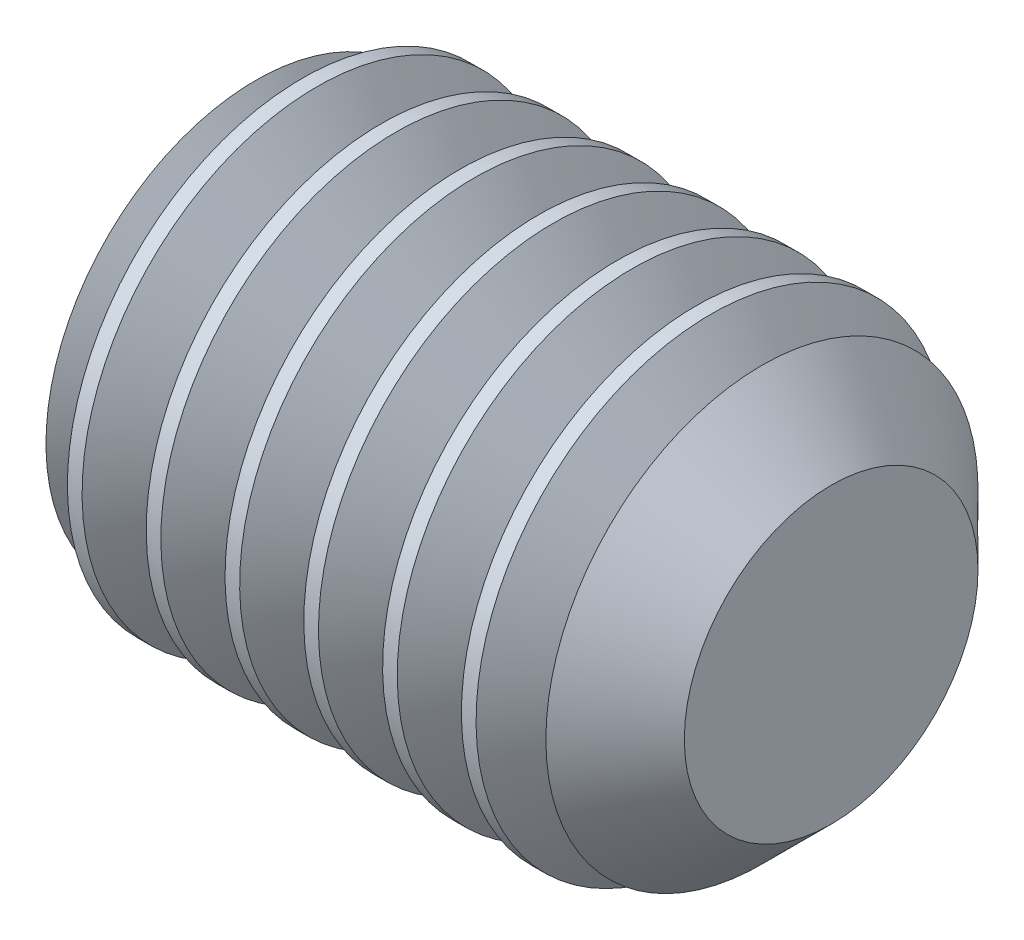
ISO-10303-21;
HEADER;
FILE_DESCRIPTION(('STEP AP214'),'2;1');
FILE_NAME('part.step','',(''),(''),'','','');
FILE_SCHEMA(('AUTOMOTIVE_DESIGN { 1 0 10303 214 1 1 1 1 }'));
ENDSEC;
DATA;
#1=APPLICATION_CONTEXT('core data for automotive mechanical design processes');
#2=APPLICATION_PROTOCOL_DEFINITION('international standard','automotive_design',2000,#1);
#3=PRODUCT_CONTEXT('',#1,'mechanical');
#4=PRODUCT('Part','Part','',(#3));
#5=PRODUCT_RELATED_PRODUCT_CATEGORY('part','',(#4));
#6=PRODUCT_DEFINITION_FORMATION('','',#4);
#7=PRODUCT_DEFINITION_CONTEXT('part definition',#1,'design');
#8=PRODUCT_DEFINITION('design','',#6,#7);
#9=PRODUCT_DEFINITION_SHAPE('','',#8);
#10=(LENGTH_UNIT() NAMED_UNIT(*) SI_UNIT(.MILLI.,.METRE.));
#11=(NAMED_UNIT(*) PLANE_ANGLE_UNIT() SI_UNIT($,.RADIAN.));
#12=(NAMED_UNIT(*) SI_UNIT($,.STERADIAN.) SOLID_ANGLE_UNIT());
#13=UNCERTAINTY_MEASURE_WITH_UNIT(LENGTH_MEASURE(1.E-05),#10,'distance_accuracy_value','');
#14=(GEOMETRIC_REPRESENTATION_CONTEXT(3) GLOBAL_UNCERTAINTY_ASSIGNED_CONTEXT((#13)) GLOBAL_UNIT_ASSIGNED_CONTEXT((#10,
#11,#12)) REPRESENTATION_CONTEXT('',''));
#15=CARTESIAN_POINT('',(0.,0.,0.));
#16=DIRECTION('',(0.,0.,1.));
#17=DIRECTION('',(1.,0.,0.));
#18=AXIS2_PLACEMENT_3D('',#15,#16,#17);
#19=CARTESIAN_POINT('',(0.,0.,0.));
#20=DIRECTION('',(-1.,0.,0.));
#21=DIRECTION('',(0.,0.,1.));
#22=AXIS2_PLACEMENT_3D('',#19,#20,#21);
#23=PLANE('',#22);
#24=CARTESIAN_POINT('',(0.,0.,0.));
#25=DIRECTION('',(-1.,0.,0.));
#26=DIRECTION('',(0.,0.,1.));
#27=AXIS2_PLACEMENT_3D('',#24,#25,#26);
#28=CIRCLE('',#27,1.61);
#29=CARTESIAN_POINT('',(0.,0.,1.61));
#30=VERTEX_POINT('',#29);
#31=EDGE_CURVE('E25',#30,#30,#28,.T.);
#32=ORIENTED_EDGE('',*,*,#31,.T.);
#33=EDGE_LOOP('',(#32));
#34=FACE_BOUND('',#33,.T.);
#35=DIRECTION('',(0.,0.,-1.));
#36=VECTOR('',#35,1.);
#37=CARTESIAN_POINT('',(0.,1.,0.577350269189622));
#38=LINE('',#37,#36);
#39=CARTESIAN_POINT('',(0.,1.,0.577350269189622));
#40=VERTEX_POINT('',#39);
#41=CARTESIAN_POINT('',(0.,1.,-0.577350269189629));
#42=VERTEX_POINT('',#41);
#43=EDGE_CURVE('E112',#40,#42,#38,.T.);
#44=ORIENTED_EDGE('',*,*,#43,.F.);
#45=DIRECTION('',(0.,-0.866025403784438,0.5));
#46=VECTOR('',#45,1.);
#47=CARTESIAN_POINT('',(0.,1.,0.577350269189622));
#48=LINE('',#47,#46);
#49=CARTESIAN_POINT('',(0.,0.,1.15470053837925));
#50=VERTEX_POINT('',#49);
#51=EDGE_CURVE('E33',#40,#50,#48,.T.);
#52=ORIENTED_EDGE('',*,*,#51,.T.);
#53=DIRECTION('',(0.,0.866025403784439,0.5));
#54=VECTOR('',#53,1.);
#55=CARTESIAN_POINT('',(0.,-1.,0.577350269189623));
#56=LINE('',#55,#54);
#57=CARTESIAN_POINT('',(0.,-1.,0.577350269189623));
#58=VERTEX_POINT('',#57);
#59=EDGE_CURVE('E102',#58,#50,#56,.T.);
#60=ORIENTED_EDGE('',*,*,#59,.F.);
#61=DIRECTION('',(0.,0.,-1.));
#62=VECTOR('',#61,1.);
#63=CARTESIAN_POINT('',(0.,-1.,0.577350269189623));
#64=LINE('',#63,#62);
#65=CARTESIAN_POINT('',(0.,-1.,-0.577350269189628));
#66=VERTEX_POINT('',#65);
#67=EDGE_CURVE('E106',#58,#66,#64,.T.);
#68=ORIENTED_EDGE('',*,*,#67,.T.);
#69=DIRECTION('',(0.,0.866025403784438,-0.5));
#70=VECTOR('',#69,1.);
#71=CARTESIAN_POINT('',(0.,-1.,-0.577350269189628));
#72=LINE('',#71,#70);
#73=CARTESIAN_POINT('',(0.,0.,-1.15470053837925));
#74=VERTEX_POINT('',#73);
#75=EDGE_CURVE('E109',#66,#74,#72,.T.);
#76=ORIENTED_EDGE('',*,*,#75,.T.);
#77=DIRECTION('',(0.,-0.866025403784439,-0.5));
#78=VECTOR('',#77,1.);
#79=CARTESIAN_POINT('',(0.,1.,-0.577350269189629));
#80=LINE('',#79,#78);
#81=EDGE_CURVE('E91',#42,#74,#80,.T.);
#82=ORIENTED_EDGE('',*,*,#81,.F.);
#83=EDGE_LOOP('',(#44,#52,#60,#68,#76,#82));
#84=FACE_BOUND('',#83,.T.);
#85=ADVANCED_FACE('F16',(#34,#84),#23,.T.);
#86=CARTESIAN_POINT('',(0.,0.,0.));
#87=DIRECTION('',(1.,0.,0.));
#88=DIRECTION('',(0.,0.,-1.));
#89=AXIS2_PLACEMENT_3D('',#86,#87,#88);
#90=CONICAL_SURFACE('',#89,1.61,1.0471975511966);
#91=CARTESIAN_POINT('',(0.101756647916099,0.,0.));
#92=DIRECTION('',(-1.,0.,0.));
#93=DIRECTION('',(0.,-1.,0.));
#94=AXIS2_PLACEMENT_3D('',#91,#92,#93);
#95=CIRCLE('',#94,1.78624768419859);
#96=CARTESIAN_POINT('',(0.1017566479161,-1.78624768419859,0.));
#97=VERTEX_POINT('',#96);
#98=EDGE_CURVE('E103',#97,#97,#95,.F.);
#99=ORIENTED_EDGE('',*,*,#98,.F.);
#100=EDGE_LOOP('',(#99));
#101=FACE_BOUND('',#100,.T.);
#102=ORIENTED_EDGE('',*,*,#31,.F.);
#103=EDGE_LOOP('',(#102));
#104=FACE_BOUND('',#103,.T.);
#105=ADVANCED_FACE('F148',(#101,#104),#90,.T.);
#106=CARTESIAN_POINT('',(2.3,1.,0.577350269189622));
#107=DIRECTION('',(0.,-0.5,-0.866025403784438));
#108=DIRECTION('',(0.,0.866025403784438,-0.5));
#109=AXIS2_PLACEMENT_3D('',#106,#107,#108);
#110=PLANE('',#109);
#111=ORIENTED_EDGE('',*,*,#51,.F.);
#112=DIRECTION('',(-1.,0.,0.));
#113=VECTOR('',#112,1.);
#114=CARTESIAN_POINT('',(2.3,1.,0.577350269189622));
#115=LINE('',#114,#113);
#116=CARTESIAN_POINT('',(2.3,1.,0.577350269189622));
#117=VERTEX_POINT('',#116);
#118=EDGE_CURVE('E38',#117,#40,#115,.T.);
#119=ORIENTED_EDGE('',*,*,#118,.F.);
#120=DIRECTION('',(0.,-0.866025403784438,0.5));
#121=VECTOR('',#120,1.);
#122=CARTESIAN_POINT('',(2.3,1.,0.577350269189622));
#123=LINE('',#122,#121);
#124=CARTESIAN_POINT('',(2.3,0.,1.15470053837925));
#125=VERTEX_POINT('',#124);
#126=EDGE_CURVE('E65',#117,#125,#123,.T.);
#127=ORIENTED_EDGE('',*,*,#126,.T.);
#128=DIRECTION('',(-1.,0.,0.));
#129=VECTOR('',#128,1.);
#130=CARTESIAN_POINT('',(2.3,0.,1.15470053837925));
#131=LINE('',#130,#129);
#132=EDGE_CURVE('E119',#125,#50,#131,.T.);
#133=ORIENTED_EDGE('',*,*,#132,.T.);
#134=EDGE_LOOP('',(#111,#119,#127,#133));
#135=FACE_BOUND('',#134,.T.);
#136=ADVANCED_FACE('F146',(#135),#110,.T.);
#137=CARTESIAN_POINT('',(2.3,-1.,0.577350269189623));
#138=DIRECTION('',(0.,-0.5,0.866025403784439));
#139=DIRECTION('',(0.,-0.866025403784439,-0.5));
#140=AXIS2_PLACEMENT_3D('',#137,#138,#139);
#141=PLANE('',#140);
#142=ORIENTED_EDGE('',*,*,#59,.T.);
#143=ORIENTED_EDGE('',*,*,#132,.F.);
#144=DIRECTION('',(0.,0.866025403784439,0.5));
#145=VECTOR('',#144,1.);
#146=CARTESIAN_POINT('',(2.3,-1.,0.577350269189623));
#147=LINE('',#146,#145);
#148=CARTESIAN_POINT('',(2.3,-1.,0.577350269189623));
#149=VERTEX_POINT('',#148);
#150=EDGE_CURVE('E137',#149,#125,#147,.T.);
#151=ORIENTED_EDGE('',*,*,#150,.F.);
#152=DIRECTION('',(-1.,0.,0.));
#153=VECTOR('',#152,1.);
#154=CARTESIAN_POINT('',(2.3,-1.,0.577350269189623));
#155=LINE('',#154,#153);
#156=EDGE_CURVE('E117',#149,#58,#155,.T.);
#157=ORIENTED_EDGE('',*,*,#156,.T.);
#158=EDGE_LOOP('',(#142,#143,#151,#157));
#159=FACE_BOUND('',#158,.T.);
#160=ADVANCED_FACE('F144',(#159),#141,.F.);
#161=CARTESIAN_POINT('',(2.3,-1.,0.577350269189623));
#162=DIRECTION('',(0.,1.,0.));
#163=DIRECTION('',(0.,0.,1.));
#164=AXIS2_PLACEMENT_3D('',#161,#162,#163);
#165=PLANE('',#164);
#166=ORIENTED_EDGE('',*,*,#67,.F.);
#167=ORIENTED_EDGE('',*,*,#156,.F.);
#168=DIRECTION('',(0.,0.,-1.));
#169=VECTOR('',#168,1.);
#170=CARTESIAN_POINT('',(2.3,-1.,0.577350269189623));
#171=LINE('',#170,#169);
#172=CARTESIAN_POINT('',(2.3,-1.,-0.577350269189628));
#173=VERTEX_POINT('',#172);
#174=EDGE_CURVE('E86',#149,#173,#171,.T.);
#175=ORIENTED_EDGE('',*,*,#174,.T.);
#176=DIRECTION('',(-1.,0.,0.));
#177=VECTOR('',#176,1.);
#178=CARTESIAN_POINT('',(2.3,-1.,-0.577350269189628));
#179=LINE('',#178,#177);
#180=EDGE_CURVE('E81',#173,#66,#179,.T.);
#181=ORIENTED_EDGE('',*,*,#180,.T.);
#182=EDGE_LOOP('',(#166,#167,#175,#181));
#183=FACE_BOUND('',#182,.T.);
#184=ADVANCED_FACE('F141',(#183),#165,.T.);
#185=CARTESIAN_POINT('',(2.3,-1.,-0.577350269189628));
#186=DIRECTION('',(0.,0.5,0.866025403784438));
#187=DIRECTION('',(0.,-0.866025403784439,0.5));
#188=AXIS2_PLACEMENT_3D('',#185,#186,#187);
#189=PLANE('',#188);
#190=ORIENTED_EDGE('',*,*,#75,.F.);
#191=ORIENTED_EDGE('',*,*,#180,.F.);
#192=DIRECTION('',(0.,0.866025403784438,-0.5));
#193=VECTOR('',#192,1.);
#194=CARTESIAN_POINT('',(2.3,-1.,-0.577350269189628));
#195=LINE('',#194,#193);
#196=CARTESIAN_POINT('',(2.3,0.,-1.15470053837925));
#197=VERTEX_POINT('',#196);
#198=EDGE_CURVE('E76',#173,#197,#195,.T.);
#199=ORIENTED_EDGE('',*,*,#198,.T.);
#200=DIRECTION('',(-1.,0.,0.));
#201=VECTOR('',#200,1.);
#202=CARTESIAN_POINT('',(2.3,0.,-1.15470053837925));
#203=LINE('',#202,#201);
#204=EDGE_CURVE('E80',#197,#74,#203,.T.);
#205=ORIENTED_EDGE('',*,*,#204,.T.);
#206=EDGE_LOOP('',(#190,#191,#199,#205));
#207=FACE_BOUND('',#206,.T.);
#208=ADVANCED_FACE('F79',(#207),#189,.T.);
#209=CARTESIAN_POINT('',(2.3,1.,-0.577350269189629));
#210=DIRECTION('',(0.,0.5,-0.866025403784439));
#211=DIRECTION('',(0.,0.866025403784439,0.5));
#212=AXIS2_PLACEMENT_3D('',#209,#210,#211);
#213=PLANE('',#212);
#214=ORIENTED_EDGE('',*,*,#81,.T.);
#215=ORIENTED_EDGE('',*,*,#204,.F.);
#216=DIRECTION('',(0.,-0.866025403784439,-0.5));
#217=VECTOR('',#216,1.);
#218=CARTESIAN_POINT('',(2.3,1.,-0.577350269189629));
#219=LINE('',#218,#217);
#220=CARTESIAN_POINT('',(2.3,1.,-0.577350269189629));
#221=VERTEX_POINT('',#220);
#222=EDGE_CURVE('E85',#221,#197,#219,.T.);
#223=ORIENTED_EDGE('',*,*,#222,.F.);
#224=DIRECTION('',(-1.,0.,0.));
#225=VECTOR('',#224,1.);
#226=CARTESIAN_POINT('',(2.3,1.,-0.577350269189629));
#227=LINE('',#226,#225);
#228=EDGE_CURVE('E61',#221,#42,#227,.T.);
#229=ORIENTED_EDGE('',*,*,#228,.T.);
#230=EDGE_LOOP('',(#214,#215,#223,#229));
#231=FACE_BOUND('',#230,.T.);
#232=ADVANCED_FACE('F88',(#231),#213,.F.);
#233=CARTESIAN_POINT('',(2.3,1.,0.577350269189622));
#234=DIRECTION('',(0.,1.,0.));
#235=DIRECTION('',(0.,0.,1.));
#236=AXIS2_PLACEMENT_3D('',#233,#234,#235);
#237=PLANE('',#236);
#238=ORIENTED_EDGE('',*,*,#43,.T.);
#239=ORIENTED_EDGE('',*,*,#228,.F.);
#240=DIRECTION('',(0.,0.,-1.));
#241=VECTOR('',#240,1.);
#242=CARTESIAN_POINT('',(2.3,1.,0.577350269189622));
#243=LINE('',#242,#241);
#244=EDGE_CURVE('E96',#117,#221,#243,.T.);
#245=ORIENTED_EDGE('',*,*,#244,.F.);
#246=ORIENTED_EDGE('',*,*,#118,.T.);
#247=EDGE_LOOP('',(#238,#239,#245,#246));
#248=FACE_BOUND('',#247,.T.);
#249=ADVANCED_FACE('F332',(#248),#237,.F.);
#250=CARTESIAN_POINT('',(2.3,2.,0.));
#251=DIRECTION('',(1.,0.,0.));
#252=DIRECTION('',(0.,0.,-1.));
#253=AXIS2_PLACEMENT_3D('',#250,#251,#252);
#254=PLANE('',#253);
#255=ORIENTED_EDGE('',*,*,#126,.F.);
#256=ORIENTED_EDGE('',*,*,#244,.T.);
#257=ORIENTED_EDGE('',*,*,#222,.T.);
#258=ORIENTED_EDGE('',*,*,#198,.F.);
#259=ORIENTED_EDGE('',*,*,#174,.F.);
#260=ORIENTED_EDGE('',*,*,#150,.T.);
#261=EDGE_LOOP('',(#255,#256,#257,#258,#259,#260));
#262=FACE_BOUND('',#261,.T.);
#263=ADVANCED_FACE('F94',(#262),#254,.F.);
#264=CARTESIAN_POINT('',(0.498247544885738,0.,0.));
#265=DIRECTION('',(1.,0.,0.));
#266=DIRECTION('',(0.,1.,0.));
#267=AXIS2_PLACEMENT_3D('',#264,#265,#266);
#268=CONICAL_SURFACE('',#267,2.,0.959931088596884);
#269=CARTESIAN_POINT('',(0.225166604983952,0.,0.));
#270=DIRECTION('',(-1.,0.,0.));
#271=DIRECTION('',(0.,-1.,0.));
#272=AXIS2_PLACEMENT_3D('',#269,#270,#271);
#273=CIRCLE('',#272,1.61);
#274=CARTESIAN_POINT('',(0.225166604983953,-1.61,0.));
#275=VERTEX_POINT('',#274);
#276=EDGE_CURVE('E127',#275,#275,#273,.T.);
#277=ORIENTED_EDGE('',*,*,#276,.F.);
#278=EDGE_LOOP('',(#277));
#279=FACE_BOUND('',#278,.T.);
#280=CARTESIAN_POINT('',(0.498247544885738,0.,0.));
#281=DIRECTION('',(-1.,0.,0.));
#282=DIRECTION('',(0.,-1.,0.));
#283=AXIS2_PLACEMENT_3D('',#280,#281,#282);
#284=CIRCLE('',#283,2.);
#285=CARTESIAN_POINT('',(0.498247544885738,-2.,0.));
#286=VERTEX_POINT('',#285);
#287=EDGE_CURVE('E123',#286,#286,#284,.T.);
#288=ORIENTED_EDGE('',*,*,#287,.T.);
#289=EDGE_LOOP('',(#288));
#290=FACE_BOUND('',#289,.T.);
#291=ADVANCED_FACE('F326',(#279,#290),#268,.T.);
#292=CARTESIAN_POINT('',(0.225166604983952,0.,0.));
#293=DIRECTION('',(-1.,0.,0.));
#294=DIRECTION('',(0.,-1.,0.));
#295=AXIS2_PLACEMENT_3D('',#292,#293,#294);
#296=CONICAL_SURFACE('',#295,1.61,0.959931088596876);
#297=ORIENTED_EDGE('',*,*,#98,.T.);
#298=EDGE_LOOP('',(#297));
#299=FACE_BOUND('',#298,.T.);
#300=ORIENTED_EDGE('',*,*,#276,.T.);
#301=EDGE_LOOP('',(#300));
#302=FACE_BOUND('',#301,.T.);
#303=ADVANCED_FACE('F170',(#299,#302),#296,.T.);
#304=CARTESIAN_POINT('',(-12.7,0.,0.));
#305=DIRECTION('',(-1.,0.,0.));
#306=DIRECTION('',(0.,0.,1.));
#307=AXIS2_PLACEMENT_3D('',#304,#305,#306);
#308=CYLINDRICAL_SURFACE('',#307,2.);
#309=CARTESIAN_POINT('',(0.622891234063827,0.,0.));
#310=DIRECTION('',(-1.,0.,0.));
#311=DIRECTION('',(0.,-1.,0.));
#312=AXIS2_PLACEMENT_3D('',#309,#310,#311);
#313=CIRCLE('',#312,2.);
#314=CARTESIAN_POINT('',(0.622891234063827,-2.,0.));
#315=VERTEX_POINT('',#314);
#316=EDGE_CURVE('E236',#315,#315,#313,.T.);
#317=ORIENTED_EDGE('',*,*,#316,.T.);
#318=EDGE_LOOP('',(#317));
#319=FACE_BOUND('',#318,.T.);
#320=ORIENTED_EDGE('',*,*,#287,.F.);
#321=EDGE_LOOP('',(#320));
#322=FACE_BOUND('',#321,.T.);
#323=ADVANCED_FACE('F167',(#319,#322),#308,.T.);
#324=CARTESIAN_POINT('',(1.1690531138674,0.,0.));
#325=DIRECTION('',(1.,0.,0.));
#326=DIRECTION('',(0.,1.,0.));
#327=AXIS2_PLACEMENT_3D('',#324,#325,#326);
#328=CONICAL_SURFACE('',#327,2.,0.959931088596884);
#329=CARTESIAN_POINT('',(0.895972173965617,0.,0.));
#330=DIRECTION('',(-1.,0.,0.));
#331=DIRECTION('',(0.,-1.,0.));
#332=AXIS2_PLACEMENT_3D('',#329,#330,#331);
#333=CIRCLE('',#332,1.61);
#334=CARTESIAN_POINT('',(0.895972173965617,-1.61,0.));
#335=VERTEX_POINT('',#334);
#336=EDGE_CURVE('E233',#335,#335,#333,.T.);
#337=ORIENTED_EDGE('',*,*,#336,.F.);
#338=EDGE_LOOP('',(#337));
#339=FACE_BOUND('',#338,.T.);
#340=CARTESIAN_POINT('',(1.1690531138674,0.,0.));
#341=DIRECTION('',(-1.,0.,0.));
#342=DIRECTION('',(0.,-1.,0.));
#343=AXIS2_PLACEMENT_3D('',#340,#341,#342);
#344=CIRCLE('',#343,2.);
#345=CARTESIAN_POINT('',(1.1690531138674,-2.,0.));
#346=VERTEX_POINT('',#345);
#347=EDGE_CURVE('E132',#346,#346,#344,.T.);
#348=ORIENTED_EDGE('',*,*,#347,.T.);
#349=EDGE_LOOP('',(#348));
#350=FACE_BOUND('',#349,.T.);
#351=ADVANCED_FACE('F169',(#339,#350),#328,.T.);
#352=CARTESIAN_POINT('',(0.895972173965617,0.,0.));
#353=DIRECTION('',(-1.,0.,0.));
#354=DIRECTION('',(0.,-1.,0.));
#355=AXIS2_PLACEMENT_3D('',#352,#353,#354);
#356=CONICAL_SURFACE('',#355,1.61,0.959931088596876);
#357=ORIENTED_EDGE('',*,*,#316,.F.);
#358=EDGE_LOOP('',(#357));
#359=FACE_BOUND('',#358,.T.);
#360=ORIENTED_EDGE('',*,*,#336,.T.);
#361=EDGE_LOOP('',(#360));
#362=FACE_BOUND('',#361,.T.);
#363=ADVANCED_FACE('F244',(#359,#362),#356,.T.);
#364=CARTESIAN_POINT('',(1.29369680304549,0.,0.));
#365=DIRECTION('',(-1.,0.,0.));
#366=DIRECTION('',(0.,-1.,0.));
#367=AXIS2_PLACEMENT_3D('',#364,#365,#366);
#368=CIRCLE('',#367,2.);
#369=CARTESIAN_POINT('',(1.29369680304549,-2.,0.));
#370=VERTEX_POINT('',#369);
#371=EDGE_CURVE('E227',#370,#370,#368,.T.);
#372=ORIENTED_EDGE('',*,*,#371,.T.);
#373=EDGE_LOOP('',(#372));
#374=FACE_BOUND('',#373,.T.);
#375=ORIENTED_EDGE('',*,*,#347,.F.);
#376=EDGE_LOOP('',(#375));
#377=FACE_BOUND('',#376,.T.);
#378=ADVANCED_FACE('F173',(#374,#377),#308,.T.);
#379=CARTESIAN_POINT('',(1.83985868284907,0.,0.));
#380=DIRECTION('',(1.,0.,0.));
#381=DIRECTION('',(0.,1.,0.));
#382=AXIS2_PLACEMENT_3D('',#379,#380,#381);
#383=CONICAL_SURFACE('',#382,2.,0.959931088596884);
#384=CARTESIAN_POINT('',(1.56677774294728,0.,0.));
#385=DIRECTION('',(-1.,0.,0.));
#386=DIRECTION('',(0.,-1.,0.));
#387=AXIS2_PLACEMENT_3D('',#384,#385,#386);
#388=CIRCLE('',#387,1.61);
#389=CARTESIAN_POINT('',(1.56677774294728,-1.61,0.));
#390=VERTEX_POINT('',#389);
#391=EDGE_CURVE('E224',#390,#390,#388,.T.);
#392=ORIENTED_EDGE('',*,*,#391,.F.);
#393=EDGE_LOOP('',(#392));
#394=FACE_BOUND('',#393,.T.);
#395=CARTESIAN_POINT('',(1.83985868284907,0.,0.));
#396=DIRECTION('',(-1.,0.,0.));
#397=DIRECTION('',(0.,-1.,0.));
#398=AXIS2_PLACEMENT_3D('',#395,#396,#397);
#399=CIRCLE('',#398,2.);
#400=CARTESIAN_POINT('',(1.83985868284907,-2.,0.));
#401=VERTEX_POINT('',#400);
#402=EDGE_CURVE('E230',#401,#401,#399,.T.);
#403=ORIENTED_EDGE('',*,*,#402,.T.);
#404=EDGE_LOOP('',(#403));
#405=FACE_BOUND('',#404,.T.);
#406=ADVANCED_FACE('F243',(#394,#405),#383,.T.);
#407=CARTESIAN_POINT('',(1.56677774294728,0.,0.));
#408=DIRECTION('',(-1.,0.,0.));
#409=DIRECTION('',(0.,-1.,0.));
#410=AXIS2_PLACEMENT_3D('',#407,#408,#409);
#411=CONICAL_SURFACE('',#410,1.61,0.959931088596876);
#412=ORIENTED_EDGE('',*,*,#371,.F.);
#413=EDGE_LOOP('',(#412));
#414=FACE_BOUND('',#413,.T.);
#415=ORIENTED_EDGE('',*,*,#391,.T.);
#416=EDGE_LOOP('',(#415));
#417=FACE_BOUND('',#416,.T.);
#418=ADVANCED_FACE('F252',(#414,#417),#411,.T.);
#419=CARTESIAN_POINT('',(1.96450237202716,0.,0.));
#420=DIRECTION('',(-1.,0.,0.));
#421=DIRECTION('',(0.,-1.,0.));
#422=AXIS2_PLACEMENT_3D('',#419,#420,#421);
#423=CIRCLE('',#422,2.);
#424=CARTESIAN_POINT('',(1.96450237202716,-2.,0.));
#425=VERTEX_POINT('',#424);
#426=EDGE_CURVE('E218',#425,#425,#423,.T.);
#427=ORIENTED_EDGE('',*,*,#426,.T.);
#428=EDGE_LOOP('',(#427));
#429=FACE_BOUND('',#428,.T.);
#430=ORIENTED_EDGE('',*,*,#402,.F.);
#431=EDGE_LOOP('',(#430));
#432=FACE_BOUND('',#431,.T.);
#433=ADVANCED_FACE('F246',(#429,#432),#308,.T.);
#434=CARTESIAN_POINT('',(2.51066425183073,0.,0.));
#435=DIRECTION('',(1.,0.,0.));
#436=DIRECTION('',(0.,1.,0.));
#437=AXIS2_PLACEMENT_3D('',#434,#435,#436);
#438=CONICAL_SURFACE('',#437,2.,0.959931088596884);
#439=CARTESIAN_POINT('',(2.23758331192894,0.,0.));
#440=DIRECTION('',(-1.,0.,0.));
#441=DIRECTION('',(0.,-1.,0.));
#442=AXIS2_PLACEMENT_3D('',#439,#440,#441);
#443=CIRCLE('',#442,1.61);
#444=CARTESIAN_POINT('',(2.23758331192894,-1.61,0.));
#445=VERTEX_POINT('',#444);
#446=EDGE_CURVE('E215',#445,#445,#443,.T.);
#447=ORIENTED_EDGE('',*,*,#446,.F.);
#448=EDGE_LOOP('',(#447));
#449=FACE_BOUND('',#448,.T.);
#450=CARTESIAN_POINT('',(2.51066425183073,0.,0.));
#451=DIRECTION('',(-1.,0.,0.));
#452=DIRECTION('',(0.,-1.,0.));
#453=AXIS2_PLACEMENT_3D('',#450,#451,#452);
#454=CIRCLE('',#453,2.);
#455=CARTESIAN_POINT('',(2.51066425183073,-2.,0.));
#456=VERTEX_POINT('',#455);
#457=EDGE_CURVE('E221',#456,#456,#454,.T.);
#458=ORIENTED_EDGE('',*,*,#457,.T.);
#459=EDGE_LOOP('',(#458));
#460=FACE_BOUND('',#459,.T.);
#461=ADVANCED_FACE('F258',(#449,#460),#438,.T.);
#462=CARTESIAN_POINT('',(2.23758331192894,0.,0.));
#463=DIRECTION('',(-1.,0.,0.));
#464=DIRECTION('',(0.,-1.,0.));
#465=AXIS2_PLACEMENT_3D('',#462,#463,#464);
#466=CONICAL_SURFACE('',#465,1.61,0.959931088596876);
#467=ORIENTED_EDGE('',*,*,#426,.F.);
#468=EDGE_LOOP('',(#467));
#469=FACE_BOUND('',#468,.T.);
#470=ORIENTED_EDGE('',*,*,#446,.T.);
#471=EDGE_LOOP('',(#470));
#472=FACE_BOUND('',#471,.T.);
#473=ADVANCED_FACE('F266',(#469,#472),#466,.T.);
#474=CARTESIAN_POINT('',(2.63530794100882,0.,0.));
#475=DIRECTION('',(-1.,0.,0.));
#476=DIRECTION('',(0.,-1.,0.));
#477=AXIS2_PLACEMENT_3D('',#474,#475,#476);
#478=CIRCLE('',#477,2.);
#479=CARTESIAN_POINT('',(2.63530794100882,-2.,0.));
#480=VERTEX_POINT('',#479);
#481=EDGE_CURVE('E209',#480,#480,#478,.T.);
#482=ORIENTED_EDGE('',*,*,#481,.T.);
#483=EDGE_LOOP('',(#482));
#484=FACE_BOUND('',#483,.T.);
#485=ORIENTED_EDGE('',*,*,#457,.F.);
#486=EDGE_LOOP('',(#485));
#487=FACE_BOUND('',#486,.T.);
#488=ADVANCED_FACE('F260',(#484,#487),#308,.T.);
#489=CARTESIAN_POINT('',(3.18146982081239,0.,0.));
#490=DIRECTION('',(1.,0.,0.));
#491=DIRECTION('',(0.,1.,0.));
#492=AXIS2_PLACEMENT_3D('',#489,#490,#491);
#493=CONICAL_SURFACE('',#492,2.,0.959931088596884);
#494=CARTESIAN_POINT('',(2.90838888091061,0.,0.));
#495=DIRECTION('',(-1.,0.,0.));
#496=DIRECTION('',(0.,-1.,0.));
#497=AXIS2_PLACEMENT_3D('',#494,#495,#496);
#498=CIRCLE('',#497,1.61);
#499=CARTESIAN_POINT('',(2.90838888091061,-1.61,0.));
#500=VERTEX_POINT('',#499);
#501=EDGE_CURVE('E206',#500,#500,#498,.T.);
#502=ORIENTED_EDGE('',*,*,#501,.F.);
#503=EDGE_LOOP('',(#502));
#504=FACE_BOUND('',#503,.T.);
#505=CARTESIAN_POINT('',(3.18146982081239,0.,0.));
#506=DIRECTION('',(-1.,0.,0.));
#507=DIRECTION('',(0.,-1.,0.));
#508=AXIS2_PLACEMENT_3D('',#505,#506,#507);
#509=CIRCLE('',#508,2.);
#510=CARTESIAN_POINT('',(3.1814698208124,-2.,0.));
#511=VERTEX_POINT('',#510);
#512=EDGE_CURVE('E212',#511,#511,#509,.T.);
#513=ORIENTED_EDGE('',*,*,#512,.T.);
#514=EDGE_LOOP('',(#513));
#515=FACE_BOUND('',#514,.T.);
#516=ADVANCED_FACE('F273',(#504,#515),#493,.T.);
#517=CARTESIAN_POINT('',(2.90838888091061,0.,0.));
#518=DIRECTION('',(-1.,0.,0.));
#519=DIRECTION('',(0.,-1.,0.));
#520=AXIS2_PLACEMENT_3D('',#517,#518,#519);
#521=CONICAL_SURFACE('',#520,1.61,0.959931088596876);
#522=ORIENTED_EDGE('',*,*,#481,.F.);
#523=EDGE_LOOP('',(#522));
#524=FACE_BOUND('',#523,.T.);
#525=ORIENTED_EDGE('',*,*,#501,.T.);
#526=EDGE_LOOP('',(#525));
#527=FACE_BOUND('',#526,.T.);
#528=ADVANCED_FACE('F281',(#524,#527),#521,.T.);
#529=CARTESIAN_POINT('',(3.30611350999048,0.,0.));
#530=DIRECTION('',(-1.,0.,0.));
#531=DIRECTION('',(0.,-1.,0.));
#532=AXIS2_PLACEMENT_3D('',#529,#530,#531);
#533=CIRCLE('',#532,2.);
#534=CARTESIAN_POINT('',(3.30611350999049,-2.,0.));
#535=VERTEX_POINT('',#534);
#536=EDGE_CURVE('E191',#535,#535,#533,.T.);
#537=ORIENTED_EDGE('',*,*,#536,.T.);
#538=EDGE_LOOP('',(#537));
#539=FACE_BOUND('',#538,.T.);
#540=ORIENTED_EDGE('',*,*,#512,.F.);
#541=EDGE_LOOP('',(#540));
#542=FACE_BOUND('',#541,.T.);
#543=ADVANCED_FACE('F275',(#539,#542),#308,.T.);
#544=CARTESIAN_POINT('',(3.85227538979406,0.,0.));
#545=DIRECTION('',(1.,0.,0.));
#546=DIRECTION('',(0.,1.,0.));
#547=AXIS2_PLACEMENT_3D('',#544,#545,#546);
#548=CONICAL_SURFACE('',#547,2.,0.959931088596884);
#549=CARTESIAN_POINT('',(3.57919444989227,0.,0.));
#550=DIRECTION('',(-1.,0.,0.));
#551=DIRECTION('',(0.,-1.,0.));
#552=AXIS2_PLACEMENT_3D('',#549,#550,#551);
#553=CIRCLE('',#552,1.61);
#554=CARTESIAN_POINT('',(3.57919444989227,-1.61,0.));
#555=VERTEX_POINT('',#554);
#556=EDGE_CURVE('E188',#555,#555,#553,.T.);
#557=ORIENTED_EDGE('',*,*,#556,.F.);
#558=EDGE_LOOP('',(#557));
#559=FACE_BOUND('',#558,.T.);
#560=CARTESIAN_POINT('',(3.85227538979406,0.,0.));
#561=DIRECTION('',(-1.,0.,0.));
#562=DIRECTION('',(0.,-1.,0.));
#563=AXIS2_PLACEMENT_3D('',#560,#561,#562);
#564=CIRCLE('',#563,2.);
#565=CARTESIAN_POINT('',(3.85227538979406,-2.,0.));
#566=VERTEX_POINT('',#565);
#567=EDGE_CURVE('E203',#566,#566,#564,.T.);
#568=ORIENTED_EDGE('',*,*,#567,.T.);
#569=EDGE_LOOP('',(#568));
#570=FACE_BOUND('',#569,.T.);
#571=ADVANCED_FACE('F288',(#559,#570),#548,.T.);
#572=CARTESIAN_POINT('',(3.57919444989227,0.,0.));
#573=DIRECTION('',(-1.,0.,0.));
#574=DIRECTION('',(0.,-1.,0.));
#575=AXIS2_PLACEMENT_3D('',#572,#573,#574);
#576=CONICAL_SURFACE('',#575,1.61,0.959931088596876);
#577=ORIENTED_EDGE('',*,*,#536,.F.);
#578=EDGE_LOOP('',(#577));
#579=FACE_BOUND('',#578,.T.);
#580=ORIENTED_EDGE('',*,*,#556,.T.);
#581=EDGE_LOOP('',(#580));
#582=FACE_BOUND('',#581,.T.);
#583=ADVANCED_FACE('F295',(#579,#582),#576,.T.);
#584=CARTESIAN_POINT('',(3.97691907897215,0.,0.));
#585=DIRECTION('',(-1.,0.,0.));
#586=DIRECTION('',(0.,-1.,0.));
#587=AXIS2_PLACEMENT_3D('',#584,#585,#586);
#588=CIRCLE('',#587,2.);
#589=CARTESIAN_POINT('',(3.97691907897215,-2.,0.));
#590=VERTEX_POINT('',#589);
#591=EDGE_CURVE('E189',#590,#590,#588,.T.);
#592=ORIENTED_EDGE('',*,*,#591,.T.);
#593=EDGE_LOOP('',(#592));
#594=FACE_BOUND('',#593,.T.);
#595=ORIENTED_EDGE('',*,*,#567,.F.);
#596=EDGE_LOOP('',(#595));
#597=FACE_BOUND('',#596,.T.);
#598=ADVANCED_FACE('F172',(#594,#597),#308,.T.);
#599=CARTESIAN_POINT('',(4.52308095877572,0.,0.));
#600=DIRECTION('',(1.,0.,0.));
#601=DIRECTION('',(0.,1.,0.));
#602=AXIS2_PLACEMENT_3D('',#599,#600,#601);
#603=CONICAL_SURFACE('',#602,2.,0.959931088596884);
#604=CARTESIAN_POINT('',(4.41061624986281,0.,0.));
#605=DIRECTION('',(1.,0.,0.));
#606=DIRECTION('',(0.,1.,0.));
#607=AXIS2_PLACEMENT_3D('',#604,#605,#606);
#608=CIRCLE('',#607,1.8393837501372);
#609=CARTESIAN_POINT('',(4.41061624986281,1.8393837501372,0.));
#610=VERTEX_POINT('',#609);
#611=EDGE_CURVE('E20',#610,#610,#608,.F.);
#612=ORIENTED_EDGE('',*,*,#611,.T.);
#613=EDGE_LOOP('',(#612));
#614=FACE_BOUND('',#613,.T.);
#615=CARTESIAN_POINT('',(4.25000001887394,0.,0.));
#616=DIRECTION('',(-1.,0.,0.));
#617=DIRECTION('',(0.,-1.,0.));
#618=AXIS2_PLACEMENT_3D('',#615,#616,#617);
#619=CIRCLE('',#618,1.61);
#620=CARTESIAN_POINT('',(4.25000001887394,-1.61,0.));
#621=VERTEX_POINT('',#620);
#622=EDGE_CURVE('E194',#621,#621,#619,.T.);
#623=ORIENTED_EDGE('',*,*,#622,.F.);
#624=EDGE_LOOP('',(#623));
#625=FACE_BOUND('',#624,.T.);
#626=ADVANCED_FACE('F302',(#614,#625),#603,.T.);
#627=CARTESIAN_POINT('',(4.25000001887394,0.,0.));
#628=DIRECTION('',(-1.,0.,0.));
#629=DIRECTION('',(0.,-1.,0.));
#630=AXIS2_PLACEMENT_3D('',#627,#628,#629);
#631=CONICAL_SURFACE('',#630,1.61,0.959931088596876);
#632=ORIENTED_EDGE('',*,*,#591,.F.);
#633=EDGE_LOOP('',(#632));
#634=FACE_BOUND('',#633,.T.);
#635=ORIENTED_EDGE('',*,*,#622,.T.);
#636=EDGE_LOOP('',(#635));
#637=FACE_BOUND('',#636,.T.);
#638=ADVANCED_FACE('F181',(#634,#637),#631,.T.);
#639=CARTESIAN_POINT('',(5.,1.25,0.));
#640=DIRECTION('',(1.,0.,0.));
#641=DIRECTION('',(0.,0.,-1.));
#642=AXIS2_PLACEMENT_3D('',#639,#640,#641);
#643=PLANE('',#642);
#644=CARTESIAN_POINT('',(5.,0.,0.));
#645=DIRECTION('',(-1.,0.,0.));
#646=DIRECTION('',(0.,0.,1.));
#647=AXIS2_PLACEMENT_3D('',#644,#645,#646);
#648=CIRCLE('',#647,1.25);
#649=CARTESIAN_POINT('',(5.,0.,1.25));
#650=VERTEX_POINT('',#649);
#651=EDGE_CURVE('E11',#650,#650,#648,.T.);
#652=ORIENTED_EDGE('',*,*,#651,.F.);
#653=EDGE_LOOP('',(#652));
#654=FACE_BOUND('',#653,.T.);
#655=ADVANCED_FACE('F18',(#654),#643,.T.);
#656=CARTESIAN_POINT('',(4.25,0.,0.));
#657=DIRECTION('',(-1.,0.,0.));
#658=DIRECTION('',(0.,0.,1.));
#659=AXIS2_PLACEMENT_3D('',#656,#657,#658);
#660=CONICAL_SURFACE('',#659,2.,0.785398163397455);
#661=ORIENTED_EDGE('',*,*,#611,.F.);
#662=EDGE_LOOP('',(#661));
#663=FACE_BOUND('',#662,.T.);
#664=ORIENTED_EDGE('',*,*,#651,.T.);
#665=EDGE_LOOP('',(#664));
#666=FACE_BOUND('',#665,.T.);
#667=ADVANCED_FACE('F174',(#663,#666),#660,.T.);
#668=CLOSED_SHELL('',(#85,#105,#136,#160,#184,#208,#232,#249,#263,#291,#303,#323,#351,#363,#378,
#406,#418,#433,#461,#473,#488,#516,#528,#543,#571,#583,#598,#626,#638,#655,#667));
#669=MANIFOLD_SOLID_BREP('B1',#668);
#670=ADVANCED_BREP_SHAPE_REPRESENTATION('',(#18,#669),#14);
#671=SHAPE_DEFINITION_REPRESENTATION(#9,#670);
ENDSEC;
END-ISO-10303-21;
